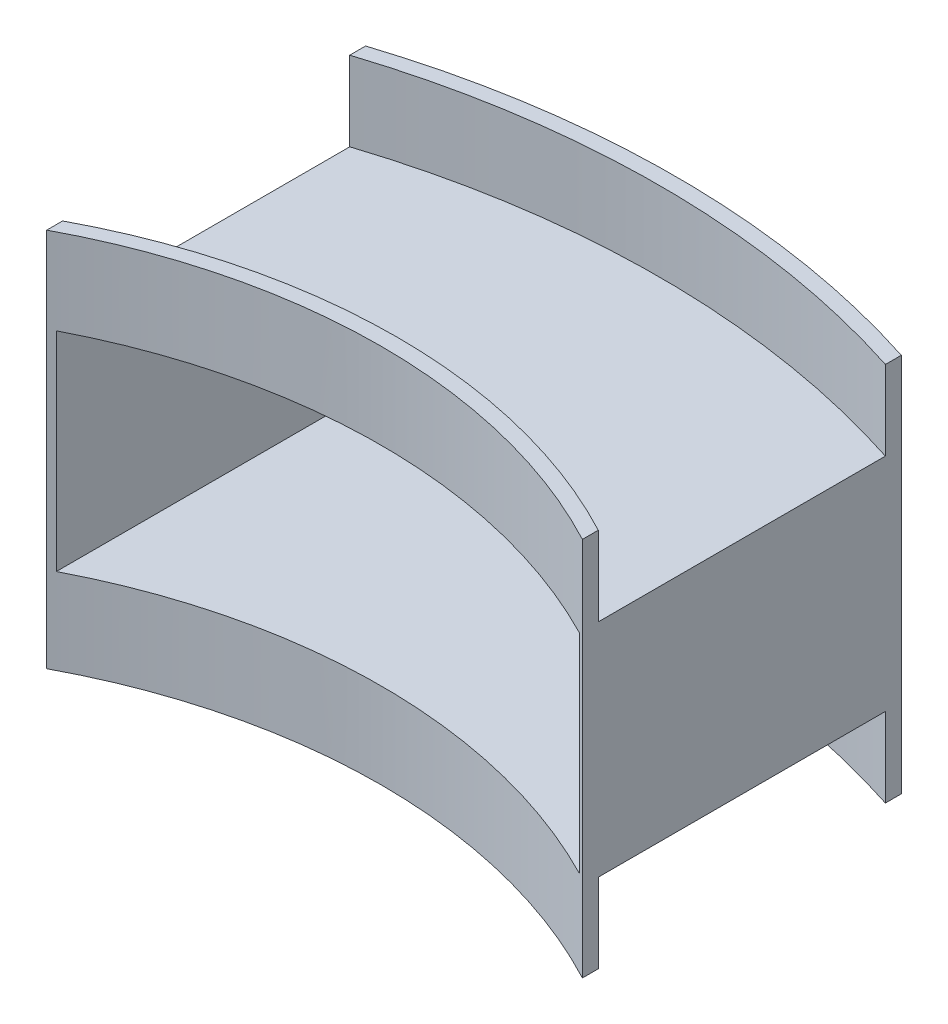
ISO-10303-21;
HEADER;
FILE_DESCRIPTION(('STEP AP214'),'2;1');
FILE_NAME('part.step','',(''),(''),'','','');
FILE_SCHEMA(('AUTOMOTIVE_DESIGN { 1 0 10303 214 1 1 1 1 }'));
ENDSEC;
DATA;
#1=APPLICATION_CONTEXT('core data for automotive mechanical design processes');
#2=APPLICATION_PROTOCOL_DEFINITION('international standard','automotive_design',2000,#1);
#3=PRODUCT_CONTEXT('',#1,'mechanical');
#4=PRODUCT('Part','Part','',(#3));
#5=PRODUCT_RELATED_PRODUCT_CATEGORY('part','',(#4));
#6=PRODUCT_DEFINITION_FORMATION('','',#4);
#7=PRODUCT_DEFINITION_CONTEXT('part definition',#1,'design');
#8=PRODUCT_DEFINITION('design','',#6,#7);
#9=PRODUCT_DEFINITION_SHAPE('','',#8);
#10=(LENGTH_UNIT() NAMED_UNIT(*) SI_UNIT(.MILLI.,.METRE.));
#11=(NAMED_UNIT(*) PLANE_ANGLE_UNIT() SI_UNIT($,.RADIAN.));
#12=(NAMED_UNIT(*) SI_UNIT($,.STERADIAN.) SOLID_ANGLE_UNIT());
#13=UNCERTAINTY_MEASURE_WITH_UNIT(LENGTH_MEASURE(1.E-05),#10,'distance_accuracy_value','');
#14=(GEOMETRIC_REPRESENTATION_CONTEXT(3) GLOBAL_UNCERTAINTY_ASSIGNED_CONTEXT((#13)) GLOBAL_UNIT_ASSIGNED_CONTEXT((#10,
#11,#12)) REPRESENTATION_CONTEXT('',''));
#15=CARTESIAN_POINT('',(0.,0.,0.));
#16=DIRECTION('',(0.,0.,1.));
#17=DIRECTION('',(1.,0.,0.));
#18=AXIS2_PLACEMENT_3D('',#15,#16,#17);
#19=CARTESIAN_POINT('',(-16.873,-6.965,11.37));
#20=DIRECTION('',(0.,1.,0.));
#21=DIRECTION('',(0.,0.,1.));
#22=AXIS2_PLACEMENT_3D('',#19,#20,#21);
#23=PLANE('',#22);
#24=CARTESIAN_POINT('',(0.,-6.965,44.63));
#25=DIRECTION('',(0.,1.,0.));
#26=DIRECTION('',(0.,0.,-1.));
#27=AXIS2_PLACEMENT_3D('',#24,#25,#26);
#28=CIRCLE('',#27,55.);
#29=CARTESIAN_POINT('',(16.873,-6.965,-7.71789270830298));
#30=VERTEX_POINT('',#29);
#31=CARTESIAN_POINT('',(-16.873,-6.965,-7.71789270830298));
#32=VERTEX_POINT('',#31);
#33=EDGE_CURVE('E73',#30,#32,#28,.T.);
#34=ORIENTED_EDGE('',*,*,#33,.F.);
#35=DIRECTION('',(0.,0.,-1.));
#36=VECTOR('',#35,1.);
#37=CARTESIAN_POINT('',(16.873,-6.965,11.37));
#38=LINE('',#37,#36);
#39=CARTESIAN_POINT('',(16.873,-6.965,10.37));
#40=VERTEX_POINT('',#39);
#41=EDGE_CURVE('E322',#40,#30,#38,.T.);
#42=ORIENTED_EDGE('',*,*,#41,.F.);
#43=CARTESIAN_POINT('',(0.,-6.965,42.1709727995859));
#44=DIRECTION('',(0.,-1.,0.));
#45=DIRECTION('',(0.,0.,-1.));
#46=AXIS2_PLACEMENT_3D('',#43,#44,#45);
#47=CIRCLE('',#46,36.);
#48=CARTESIAN_POINT('',(-16.873,-6.965,10.37));
#49=VERTEX_POINT('',#48);
#50=EDGE_CURVE('E211',#49,#40,#47,.T.);
#51=ORIENTED_EDGE('',*,*,#50,.F.);
#52=DIRECTION('',(0.,0.,-1.));
#53=VECTOR('',#52,1.);
#54=CARTESIAN_POINT('',(-16.873,-6.965,11.37));
#55=LINE('',#54,#53);
#56=EDGE_CURVE('E78',#49,#32,#55,.T.);
#57=ORIENTED_EDGE('',*,*,#56,.T.);
#58=EDGE_LOOP('',(#34,#42,#51,#57));
#59=FACE_BOUND('',#58,.T.);
#60=ADVANCED_FACE('F57',(#59),#23,.F.);
#61=CARTESIAN_POINT('',(-16.873,6.965,11.37));
#62=DIRECTION('',(0.,-1.,0.));
#63=DIRECTION('',(0.,0.,-1.));
#64=AXIS2_PLACEMENT_3D('',#61,#62,#63);
#65=PLANE('',#64);
#66=CARTESIAN_POINT('',(0.,6.965,44.63));
#67=DIRECTION('',(0.,-1.,0.));
#68=DIRECTION('',(0.,0.,-1.));
#69=AXIS2_PLACEMENT_3D('',#66,#67,#68);
#70=CIRCLE('',#69,55.);
#71=CARTESIAN_POINT('',(-16.873,6.965,-7.71789270830298));
#72=VERTEX_POINT('',#71);
#73=CARTESIAN_POINT('',(16.873,6.965,-7.71789270830298));
#74=VERTEX_POINT('',#73);
#75=EDGE_CURVE('E237',#72,#74,#70,.T.);
#76=ORIENTED_EDGE('',*,*,#75,.F.);
#77=DIRECTION('',(0.,0.,-1.));
#78=VECTOR('',#77,1.);
#79=CARTESIAN_POINT('',(-16.873,6.965,11.37));
#80=LINE('',#79,#78);
#81=CARTESIAN_POINT('',(-16.873,6.965,10.37));
#82=VERTEX_POINT('',#81);
#83=EDGE_CURVE('E327',#82,#72,#80,.T.);
#84=ORIENTED_EDGE('',*,*,#83,.F.);
#85=CARTESIAN_POINT('',(0.,6.965,42.1709727995859));
#86=DIRECTION('',(0.,1.,0.));
#87=DIRECTION('',(0.,0.,-1.));
#88=AXIS2_PLACEMENT_3D('',#85,#86,#87);
#89=CIRCLE('',#88,36.);
#90=CARTESIAN_POINT('',(16.873,6.965,10.37));
#91=VERTEX_POINT('',#90);
#92=EDGE_CURVE('E258',#91,#82,#89,.T.);
#93=ORIENTED_EDGE('',*,*,#92,.F.);
#94=DIRECTION('',(0.,0.,-1.));
#95=VECTOR('',#94,1.);
#96=CARTESIAN_POINT('',(16.873,6.965,11.37));
#97=LINE('',#96,#95);
#98=EDGE_CURVE('E331',#91,#74,#97,.T.);
#99=ORIENTED_EDGE('',*,*,#98,.T.);
#100=EDGE_LOOP('',(#76,#84,#93,#99));
#101=FACE_BOUND('',#100,.T.);
#102=ADVANCED_FACE('F374',(#101),#65,.F.);
#103=CARTESIAN_POINT('',(-16.473,6.565,11.37));
#104=DIRECTION('',(0.,-1.,0.));
#105=DIRECTION('',(0.,0.,-1.));
#106=AXIS2_PLACEMENT_3D('',#103,#104,#105);
#107=PLANE('',#106);
#108=DIRECTION('',(0.,0.,-1.));
#109=VECTOR('',#108,1.);
#110=CARTESIAN_POINT('',(-16.473,6.565,11.37));
#111=LINE('',#110,#109);
#112=CARTESIAN_POINT('',(-16.473,6.565,11.1609701285457));
#113=VERTEX_POINT('',#112);
#114=CARTESIAN_POINT('',(-16.473,6.565,-8.84513955198214));
#115=VERTEX_POINT('',#114);
#116=EDGE_CURVE('E308',#113,#115,#111,.T.);
#117=ORIENTED_EDGE('',*,*,#116,.T.);
#118=CARTESIAN_POINT('',(0.,6.565,43.63));
#119=DIRECTION('',(0.,-1.,0.));
#120=DIRECTION('',(0.,0.,-1.));
#121=AXIS2_PLACEMENT_3D('',#118,#119,#120);
#122=CIRCLE('',#121,55.);
#123=CARTESIAN_POINT('',(16.473,6.565,-8.84513955198214));
#124=VERTEX_POINT('',#123);
#125=EDGE_CURVE('E288',#124,#115,#122,.F.);
#126=ORIENTED_EDGE('',*,*,#125,.F.);
#127=DIRECTION('',(0.,0.,-1.));
#128=VECTOR('',#127,1.);
#129=CARTESIAN_POINT('',(16.473,6.565,11.37));
#130=LINE('',#129,#128);
#131=CARTESIAN_POINT('',(16.473,6.565,11.1609701285457));
#132=VERTEX_POINT('',#131);
#133=EDGE_CURVE('E312',#132,#124,#130,.T.);
#134=ORIENTED_EDGE('',*,*,#133,.F.);
#135=CARTESIAN_POINT('',(0.,6.565,43.1709727995859));
#136=DIRECTION('',(0.,-1.,0.));
#137=DIRECTION('',(0.,0.,-1.));
#138=AXIS2_PLACEMENT_3D('',#135,#136,#137);
#139=CIRCLE('',#138,36.);
#140=EDGE_CURVE('E294',#113,#132,#139,.T.);
#141=ORIENTED_EDGE('',*,*,#140,.F.);
#142=EDGE_LOOP('',(#117,#126,#134,#141));
#143=FACE_BOUND('',#142,.T.);
#144=ADVANCED_FACE('F357',(#143),#107,.T.);
#145=CARTESIAN_POINT('',(-16.473,-6.565,11.37));
#146=DIRECTION('',(0.,1.,0.));
#147=DIRECTION('',(0.,0.,1.));
#148=AXIS2_PLACEMENT_3D('',#145,#146,#147);
#149=PLANE('',#148);
#150=CARTESIAN_POINT('',(0.,-6.565,43.63));
#151=DIRECTION('',(0.,1.,0.));
#152=DIRECTION('',(0.,0.,1.));
#153=AXIS2_PLACEMENT_3D('',#150,#151,#152);
#154=CIRCLE('',#153,55.);
#155=CARTESIAN_POINT('',(-16.473,-6.565,-8.84513955198214));
#156=VERTEX_POINT('',#155);
#157=CARTESIAN_POINT('',(16.473,-6.565,-8.84513955198214));
#158=VERTEX_POINT('',#157);
#159=EDGE_CURVE('E335',#156,#158,#154,.F.);
#160=ORIENTED_EDGE('',*,*,#159,.F.);
#161=DIRECTION('',(0.,0.,-1.));
#162=VECTOR('',#161,1.);
#163=CARTESIAN_POINT('',(-16.473,-6.565,11.37));
#164=LINE('',#163,#162);
#165=CARTESIAN_POINT('',(-16.473,-6.565,11.1609701285457));
#166=VERTEX_POINT('',#165);
#167=EDGE_CURVE('E304',#166,#156,#164,.T.);
#168=ORIENTED_EDGE('',*,*,#167,.F.);
#169=CARTESIAN_POINT('',(0.,-6.565,43.1709727995859));
#170=DIRECTION('',(0.,1.,0.));
#171=DIRECTION('',(0.,0.,1.));
#172=AXIS2_PLACEMENT_3D('',#169,#170,#171);
#173=CIRCLE('',#172,36.);
#174=CARTESIAN_POINT('',(16.473,-6.565,11.1609701285457));
#175=VERTEX_POINT('',#174);
#176=EDGE_CURVE('E66',#175,#166,#173,.T.);
#177=ORIENTED_EDGE('',*,*,#176,.F.);
#178=DIRECTION('',(0.,0.,-1.));
#179=VECTOR('',#178,1.);
#180=CARTESIAN_POINT('',(16.473,-6.565,11.37));
#181=LINE('',#180,#179);
#182=EDGE_CURVE('E300',#175,#158,#181,.T.);
#183=ORIENTED_EDGE('',*,*,#182,.T.);
#184=EDGE_LOOP('',(#160,#168,#177,#183));
#185=FACE_BOUND('',#184,.T.);
#186=ADVANCED_FACE('F352',(#185),#149,.T.);
#187=CARTESIAN_POINT('',(16.873,-6.965,11.37));
#188=DIRECTION('',(-1.,0.,0.));
#189=DIRECTION('',(0.,0.,1.));
#190=AXIS2_PLACEMENT_3D('',#187,#188,#189);
#191=PLANE('',#190);
#192=DIRECTION('',(0.,1.,0.));
#193=VECTOR('',#192,1.);
#194=CARTESIAN_POINT('',(16.873,-6.965,11.37));
#195=LINE('',#194,#193);
#196=CARTESIAN_POINT('',(16.873,-11.965,11.37));
#197=VERTEX_POINT('',#196);
#198=CARTESIAN_POINT('',(16.873,11.965,11.37));
#199=VERTEX_POINT('',#198);
#200=EDGE_CURVE('E316',#197,#199,#195,.T.);
#201=ORIENTED_EDGE('',*,*,#200,.F.);
#202=DIRECTION('',(0.,0.,1.));
#203=VECTOR('',#202,1.);
#204=CARTESIAN_POINT('',(16.873,-11.965,11.37));
#205=LINE('',#204,#203);
#206=CARTESIAN_POINT('',(16.873,-11.965,10.37));
#207=VERTEX_POINT('',#206);
#208=EDGE_CURVE('E222',#207,#197,#205,.T.);
#209=ORIENTED_EDGE('',*,*,#208,.F.);
#210=DIRECTION('',(0.,1.,0.));
#211=VECTOR('',#210,1.);
#212=CARTESIAN_POINT('',(16.873,-11.965,10.37));
#213=LINE('',#212,#211);
#214=EDGE_CURVE('E226',#207,#40,#213,.T.);
#215=ORIENTED_EDGE('',*,*,#214,.T.);
#216=ORIENTED_EDGE('',*,*,#41,.T.);
#217=DIRECTION('',(0.,1.,0.));
#218=VECTOR('',#217,1.);
#219=CARTESIAN_POINT('',(16.873,-11.965,-7.71789270830298));
#220=LINE('',#219,#218);
#221=CARTESIAN_POINT('',(16.873,-11.965,-7.71789270830298));
#222=VERTEX_POINT('',#221);
#223=EDGE_CURVE('E186',#222,#30,#220,.T.);
#224=ORIENTED_EDGE('',*,*,#223,.F.);
#225=DIRECTION('',(0.,0.,1.));
#226=VECTOR('',#225,1.);
#227=CARTESIAN_POINT('',(16.873,-11.965,-8.71789270830297));
#228=LINE('',#227,#226);
#229=CARTESIAN_POINT('',(16.873,-11.965,-8.71789270830297));
#230=VERTEX_POINT('',#229);
#231=EDGE_CURVE('E184',#230,#222,#228,.T.);
#232=ORIENTED_EDGE('',*,*,#231,.F.);
#233=DIRECTION('',(0.,1.,0.));
#234=VECTOR('',#233,1.);
#235=CARTESIAN_POINT('',(16.873,-6.965,-8.71789270830297));
#236=LINE('',#235,#234);
#237=CARTESIAN_POINT('',(16.873,11.965,-8.71789270830297));
#238=VERTEX_POINT('',#237);
#239=EDGE_CURVE('E169',#230,#238,#236,.T.);
#240=ORIENTED_EDGE('',*,*,#239,.T.);
#241=DIRECTION('',(0.,0.,-1.));
#242=VECTOR('',#241,1.);
#243=CARTESIAN_POINT('',(16.873,11.965,-8.71789270830297));
#244=LINE('',#243,#242);
#245=CARTESIAN_POINT('',(16.873,11.965,-7.71789270830298));
#246=VERTEX_POINT('',#245);
#247=EDGE_CURVE('E246',#246,#238,#244,.T.);
#248=ORIENTED_EDGE('',*,*,#247,.F.);
#249=DIRECTION('',(0.,-1.,0.));
#250=VECTOR('',#249,1.);
#251=CARTESIAN_POINT('',(16.873,11.965,-7.71789270830298));
#252=LINE('',#251,#250);
#253=EDGE_CURVE('E249',#246,#74,#252,.T.);
#254=ORIENTED_EDGE('',*,*,#253,.T.);
#255=ORIENTED_EDGE('',*,*,#98,.F.);
#256=DIRECTION('',(0.,-1.,0.));
#257=VECTOR('',#256,1.);
#258=CARTESIAN_POINT('',(16.873,11.965,10.37));
#259=LINE('',#258,#257);
#260=CARTESIAN_POINT('',(16.873,11.965,10.37));
#261=VERTEX_POINT('',#260);
#262=EDGE_CURVE('E280',#261,#91,#259,.T.);
#263=ORIENTED_EDGE('',*,*,#262,.F.);
#264=DIRECTION('',(0.,0.,-1.));
#265=VECTOR('',#264,1.);
#266=CARTESIAN_POINT('',(16.873,11.965,11.37));
#267=LINE('',#266,#265);
#268=EDGE_CURVE('E263',#199,#261,#267,.T.);
#269=ORIENTED_EDGE('',*,*,#268,.F.);
#270=EDGE_LOOP('',(#201,#209,#215,#216,#224,#232,#240,#248,#254,#255,#263,#269));
#271=FACE_BOUND('',#270,.T.);
#272=ADVANCED_FACE('F59',(#271),#191,.F.);
#273=CARTESIAN_POINT('',(-16.873,-6.965,11.37));
#274=DIRECTION('',(1.,0.,0.));
#275=DIRECTION('',(0.,0.,-1.));
#276=AXIS2_PLACEMENT_3D('',#273,#274,#275);
#277=PLANE('',#276);
#278=DIRECTION('',(0.,-1.,0.));
#279=VECTOR('',#278,1.);
#280=CARTESIAN_POINT('',(-16.873,-6.965,11.37));
#281=LINE('',#280,#279);
#282=CARTESIAN_POINT('',(-16.873,11.965,11.37));
#283=VERTEX_POINT('',#282);
#284=CARTESIAN_POINT('',(-16.873,-11.965,11.37));
#285=VERTEX_POINT('',#284);
#286=EDGE_CURVE('E319',#283,#285,#281,.T.);
#287=ORIENTED_EDGE('',*,*,#286,.F.);
#288=DIRECTION('',(0.,0.,1.));
#289=VECTOR('',#288,1.);
#290=CARTESIAN_POINT('',(-16.873,11.965,11.37));
#291=LINE('',#290,#289);
#292=CARTESIAN_POINT('',(-16.873,11.965,10.37));
#293=VERTEX_POINT('',#292);
#294=EDGE_CURVE('E269',#293,#283,#291,.T.);
#295=ORIENTED_EDGE('',*,*,#294,.F.);
#296=DIRECTION('',(0.,-1.,0.));
#297=VECTOR('',#296,1.);
#298=CARTESIAN_POINT('',(-16.873,11.965,10.37));
#299=LINE('',#298,#297);
#300=EDGE_CURVE('E273',#293,#82,#299,.T.);
#301=ORIENTED_EDGE('',*,*,#300,.T.);
#302=ORIENTED_EDGE('',*,*,#83,.T.);
#303=DIRECTION('',(0.,-1.,0.));
#304=VECTOR('',#303,1.);
#305=CARTESIAN_POINT('',(-16.873,11.965,-7.71789270830298));
#306=LINE('',#305,#304);
#307=CARTESIAN_POINT('',(-16.873,11.965,-7.71789270830298));
#308=VERTEX_POINT('',#307);
#309=EDGE_CURVE('E255',#308,#72,#306,.T.);
#310=ORIENTED_EDGE('',*,*,#309,.F.);
#311=DIRECTION('',(0.,0.,1.));
#312=VECTOR('',#311,1.);
#313=CARTESIAN_POINT('',(-16.873,11.965,-8.71789270830297));
#314=LINE('',#313,#312);
#315=CARTESIAN_POINT('',(-16.873,11.965,-8.71789270830297));
#316=VERTEX_POINT('',#315);
#317=EDGE_CURVE('E240',#316,#308,#314,.T.);
#318=ORIENTED_EDGE('',*,*,#317,.F.);
#319=DIRECTION('',(0.,1.,0.));
#320=VECTOR('',#319,1.);
#321=CARTESIAN_POINT('',(-16.873,-6.965,-8.71789270830297));
#322=LINE('',#321,#320);
#323=CARTESIAN_POINT('',(-16.873,-11.965,-8.71789270830297));
#324=VERTEX_POINT('',#323);
#325=EDGE_CURVE('E181',#324,#316,#322,.T.);
#326=ORIENTED_EDGE('',*,*,#325,.F.);
#327=DIRECTION('',(0.,0.,-1.));
#328=VECTOR('',#327,1.);
#329=CARTESIAN_POINT('',(-16.873,-11.965,-8.71789270830297));
#330=LINE('',#329,#328);
#331=CARTESIAN_POINT('',(-16.873,-11.965,-7.71789270830298));
#332=VERTEX_POINT('',#331);
#333=EDGE_CURVE('E195',#332,#324,#330,.T.);
#334=ORIENTED_EDGE('',*,*,#333,.F.);
#335=DIRECTION('',(0.,1.,0.));
#336=VECTOR('',#335,1.);
#337=CARTESIAN_POINT('',(-16.873,-11.965,-7.71789270830298));
#338=LINE('',#337,#336);
#339=EDGE_CURVE('E204',#332,#32,#338,.T.);
#340=ORIENTED_EDGE('',*,*,#339,.T.);
#341=ORIENTED_EDGE('',*,*,#56,.F.);
#342=DIRECTION('',(0.,1.,0.));
#343=VECTOR('',#342,1.);
#344=CARTESIAN_POINT('',(-16.873,-11.965,10.37));
#345=LINE('',#344,#343);
#346=CARTESIAN_POINT('',(-16.873,-11.965,10.37));
#347=VERTEX_POINT('',#346);
#348=EDGE_CURVE('E233',#347,#49,#345,.T.);
#349=ORIENTED_EDGE('',*,*,#348,.F.);
#350=DIRECTION('',(0.,0.,-1.));
#351=VECTOR('',#350,1.);
#352=CARTESIAN_POINT('',(-16.873,-11.965,11.37));
#353=LINE('',#352,#351);
#354=EDGE_CURVE('E216',#285,#347,#353,.T.);
#355=ORIENTED_EDGE('',*,*,#354,.F.);
#356=EDGE_LOOP('',(#287,#295,#301,#302,#310,#318,#326,#334,#340,#341,#349,#355));
#357=FACE_BOUND('',#356,.T.);
#358=ADVANCED_FACE('F362',(#357),#277,.F.);
#359=CARTESIAN_POINT('',(16.473,-6.565,11.37));
#360=DIRECTION('',(-1.,0.,0.));
#361=DIRECTION('',(0.,0.,1.));
#362=AXIS2_PLACEMENT_3D('',#359,#360,#361);
#363=PLANE('',#362);
#364=DIRECTION('',(0.,1.,0.));
#365=VECTOR('',#364,1.);
#366=CARTESIAN_POINT('',(16.473,-6.965,11.1609701285457));
#367=LINE('',#366,#365);
#368=EDGE_CURVE('E297',#132,#175,#367,.F.);
#369=ORIENTED_EDGE('',*,*,#368,.F.);
#370=ORIENTED_EDGE('',*,*,#133,.T.);
#371=DIRECTION('',(0.,1.,0.));
#372=VECTOR('',#371,1.);
#373=CARTESIAN_POINT('',(16.473,-6.965,-8.84513955198214));
#374=LINE('',#373,#372);
#375=EDGE_CURVE('E180',#158,#124,#374,.T.);
#376=ORIENTED_EDGE('',*,*,#375,.F.);
#377=ORIENTED_EDGE('',*,*,#182,.F.);
#378=EDGE_LOOP('',(#369,#370,#376,#377));
#379=FACE_BOUND('',#378,.T.);
#380=ADVANCED_FACE('F360',(#379),#363,.T.);
#381=CARTESIAN_POINT('',(-16.473,-6.565,11.37));
#382=DIRECTION('',(1.,0.,0.));
#383=DIRECTION('',(0.,0.,-1.));
#384=AXIS2_PLACEMENT_3D('',#381,#382,#383);
#385=PLANE('',#384);
#386=DIRECTION('',(0.,1.,0.));
#387=VECTOR('',#386,1.);
#388=CARTESIAN_POINT('',(-16.473,-6.965,-8.84513955198214));
#389=LINE('',#388,#387);
#390=EDGE_CURVE('E12',#115,#156,#389,.F.);
#391=ORIENTED_EDGE('',*,*,#390,.F.);
#392=ORIENTED_EDGE('',*,*,#116,.F.);
#393=DIRECTION('',(0.,1.,0.));
#394=VECTOR('',#393,1.);
#395=CARTESIAN_POINT('',(-16.473,-6.965,11.1609701285457));
#396=LINE('',#395,#394);
#397=EDGE_CURVE('E291',#166,#113,#396,.T.);
#398=ORIENTED_EDGE('',*,*,#397,.F.);
#399=ORIENTED_EDGE('',*,*,#167,.T.);
#400=EDGE_LOOP('',(#391,#392,#398,#399));
#401=FACE_BOUND('',#400,.T.);
#402=ADVANCED_FACE('F351',(#401),#385,.T.);
#403=CARTESIAN_POINT('',(0.,-6.965,43.63));
#404=DIRECTION('',(0.,1.,0.));
#405=DIRECTION('',(0.,0.,1.));
#406=AXIS2_PLACEMENT_3D('',#403,#404,#405);
#407=CYLINDRICAL_SURFACE('',#406,55.);
#408=ORIENTED_EDGE('',*,*,#390,.T.);
#409=ORIENTED_EDGE('',*,*,#159,.T.);
#410=ORIENTED_EDGE('',*,*,#375,.T.);
#411=ORIENTED_EDGE('',*,*,#125,.T.);
#412=EDGE_LOOP('',(#408,#409,#410,#411));
#413=FACE_BOUND('',#412,.T.);
#414=ORIENTED_EDGE('',*,*,#239,.F.);
#415=CARTESIAN_POINT('',(0.,-11.965,43.6299999999993));
#416=DIRECTION('',(0.,-1.,0.));
#417=DIRECTION('',(0.,0.,-1.));
#418=AXIS2_PLACEMENT_3D('',#415,#416,#417);
#419=CIRCLE('',#418,54.9999999999994);
#420=EDGE_CURVE('E173',#324,#230,#419,.T.);
#421=ORIENTED_EDGE('',*,*,#420,.F.);
#422=ORIENTED_EDGE('',*,*,#325,.T.);
#423=CARTESIAN_POINT('',(0.,11.965,43.629999999999));
#424=DIRECTION('',(0.,1.,0.));
#425=DIRECTION('',(0.,0.,-1.));
#426=AXIS2_PLACEMENT_3D('',#423,#424,#425);
#427=CIRCLE('',#426,54.999999999999);
#428=EDGE_CURVE('E175',#238,#316,#427,.T.);
#429=ORIENTED_EDGE('',*,*,#428,.F.);
#430=EDGE_LOOP('',(#414,#421,#422,#429));
#431=FACE_BOUND('',#430,.T.);
#432=ADVANCED_FACE('F171',(#413,#431),#407,.T.);
#433=CARTESIAN_POINT('',(0.,-6.965,43.1709727995859));
#434=DIRECTION('',(0.,1.,0.));
#435=DIRECTION('',(0.,0.,1.));
#436=AXIS2_PLACEMENT_3D('',#433,#434,#435);
#437=CYLINDRICAL_SURFACE('',#436,36.);
#438=ORIENTED_EDGE('',*,*,#368,.T.);
#439=ORIENTED_EDGE('',*,*,#176,.T.);
#440=ORIENTED_EDGE('',*,*,#397,.T.);
#441=ORIENTED_EDGE('',*,*,#140,.T.);
#442=EDGE_LOOP('',(#438,#439,#440,#441));
#443=FACE_BOUND('',#442,.T.);
#444=ORIENTED_EDGE('',*,*,#200,.T.);
#445=CARTESIAN_POINT('',(0.,11.965,43.1709727995859));
#446=DIRECTION('',(0.,-1.,0.));
#447=DIRECTION('',(0.,0.,-1.));
#448=AXIS2_PLACEMENT_3D('',#445,#446,#447);
#449=CIRCLE('',#448,36.);
#450=EDGE_CURVE('E259',#283,#199,#449,.T.);
#451=ORIENTED_EDGE('',*,*,#450,.F.);
#452=ORIENTED_EDGE('',*,*,#286,.T.);
#453=CARTESIAN_POINT('',(0.,-11.965,43.170972799586));
#454=DIRECTION('',(0.,1.,0.));
#455=DIRECTION('',(0.,0.,-1.));
#456=AXIS2_PLACEMENT_3D('',#453,#454,#455);
#457=CIRCLE('',#456,36.0000000000001);
#458=EDGE_CURVE('E212',#197,#285,#457,.T.);
#459=ORIENTED_EDGE('',*,*,#458,.F.);
#460=EDGE_LOOP('',(#444,#451,#452,#459));
#461=FACE_BOUND('',#460,.T.);
#462=ADVANCED_FACE('F341',(#443,#461),#437,.F.);
#463=CARTESIAN_POINT('',(0.,11.965,42.1709727995859));
#464=DIRECTION('',(0.,-1.,0.));
#465=DIRECTION('',(0.,0.,-1.));
#466=AXIS2_PLACEMENT_3D('',#463,#464,#465);
#467=CYLINDRICAL_SURFACE('',#466,36.);
#468=ORIENTED_EDGE('',*,*,#92,.T.);
#469=ORIENTED_EDGE('',*,*,#300,.F.);
#470=CARTESIAN_POINT('',(0.,11.965,42.1709727995859));
#471=DIRECTION('',(0.,1.,0.));
#472=DIRECTION('',(0.,0.,-1.));
#473=AXIS2_PLACEMENT_3D('',#470,#471,#472);
#474=CIRCLE('',#473,36.);
#475=EDGE_CURVE('E266',#261,#293,#474,.T.);
#476=ORIENTED_EDGE('',*,*,#475,.F.);
#477=ORIENTED_EDGE('',*,*,#262,.T.);
#478=EDGE_LOOP('',(#468,#469,#476,#477));
#479=FACE_BOUND('',#478,.T.);
#480=ADVANCED_FACE('F393',(#479),#467,.T.);
#481=CARTESIAN_POINT('',(0.,11.965,43.1709727995859));
#482=DIRECTION('',(0.,-1.,0.));
#483=DIRECTION('',(0.,0.,-1.));
#484=AXIS2_PLACEMENT_3D('',#481,#482,#483);
#485=PLANE('',#484);
#486=ORIENTED_EDGE('',*,*,#450,.T.);
#487=ORIENTED_EDGE('',*,*,#268,.T.);
#488=ORIENTED_EDGE('',*,*,#475,.T.);
#489=ORIENTED_EDGE('',*,*,#294,.T.);
#490=EDGE_LOOP('',(#486,#487,#488,#489));
#491=FACE_BOUND('',#490,.T.);
#492=ADVANCED_FACE('F422',(#491),#485,.F.);
#493=CARTESIAN_POINT('',(0.,11.965,44.63));
#494=DIRECTION('',(0.,-1.,0.));
#495=DIRECTION('',(0.,0.,-1.));
#496=AXIS2_PLACEMENT_3D('',#493,#494,#495);
#497=CYLINDRICAL_SURFACE('',#496,55.);
#498=ORIENTED_EDGE('',*,*,#75,.T.);
#499=ORIENTED_EDGE('',*,*,#253,.F.);
#500=CARTESIAN_POINT('',(0.,11.965,44.63));
#501=DIRECTION('',(0.,-1.,0.));
#502=DIRECTION('',(0.,0.,-1.));
#503=AXIS2_PLACEMENT_3D('',#500,#501,#502);
#504=CIRCLE('',#503,55.);
#505=EDGE_CURVE('E243',#308,#246,#504,.T.);
#506=ORIENTED_EDGE('',*,*,#505,.F.);
#507=ORIENTED_EDGE('',*,*,#309,.T.);
#508=EDGE_LOOP('',(#498,#499,#506,#507));
#509=FACE_BOUND('',#508,.T.);
#510=ADVANCED_FACE('F396',(#509),#497,.F.);
#511=CARTESIAN_POINT('',(0.,11.965,43.629999999999));
#512=DIRECTION('',(0.,-1.,0.));
#513=DIRECTION('',(0.,0.,-1.));
#514=AXIS2_PLACEMENT_3D('',#511,#512,#513);
#515=PLANE('',#514);
#516=ORIENTED_EDGE('',*,*,#428,.T.);
#517=ORIENTED_EDGE('',*,*,#317,.T.);
#518=ORIENTED_EDGE('',*,*,#505,.T.);
#519=ORIENTED_EDGE('',*,*,#247,.T.);
#520=EDGE_LOOP('',(#516,#517,#518,#519));
#521=FACE_BOUND('',#520,.T.);
#522=ADVANCED_FACE('F398',(#521),#515,.F.);
#523=CARTESIAN_POINT('',(0.,-11.965,42.1709727995859));
#524=DIRECTION('',(0.,1.,0.));
#525=DIRECTION('',(0.,0.,1.));
#526=AXIS2_PLACEMENT_3D('',#523,#524,#525);
#527=CYLINDRICAL_SURFACE('',#526,36.);
#528=ORIENTED_EDGE('',*,*,#50,.T.);
#529=ORIENTED_EDGE('',*,*,#214,.F.);
#530=CARTESIAN_POINT('',(0.,-11.965,42.1709727995859));
#531=DIRECTION('',(0.,-1.,0.));
#532=DIRECTION('',(0.,0.,-1.));
#533=AXIS2_PLACEMENT_3D('',#530,#531,#532);
#534=CIRCLE('',#533,36.);
#535=EDGE_CURVE('E219',#347,#207,#534,.T.);
#536=ORIENTED_EDGE('',*,*,#535,.F.);
#537=ORIENTED_EDGE('',*,*,#348,.T.);
#538=EDGE_LOOP('',(#528,#529,#536,#537));
#539=FACE_BOUND('',#538,.T.);
#540=ADVANCED_FACE('F411',(#539),#527,.T.);
#541=CARTESIAN_POINT('',(0.,-11.965,43.170972799586));
#542=DIRECTION('',(0.,-1.,0.));
#543=DIRECTION('',(0.,0.,-1.));
#544=AXIS2_PLACEMENT_3D('',#541,#542,#543);
#545=PLANE('',#544);
#546=ORIENTED_EDGE('',*,*,#458,.T.);
#547=ORIENTED_EDGE('',*,*,#354,.T.);
#548=ORIENTED_EDGE('',*,*,#535,.T.);
#549=ORIENTED_EDGE('',*,*,#208,.T.);
#550=EDGE_LOOP('',(#546,#547,#548,#549));
#551=FACE_BOUND('',#550,.T.);
#552=ADVANCED_FACE('F404',(#551),#545,.T.);
#553=CARTESIAN_POINT('',(0.,-11.965,44.63));
#554=DIRECTION('',(0.,1.,0.));
#555=DIRECTION('',(0.,0.,1.));
#556=AXIS2_PLACEMENT_3D('',#553,#554,#555);
#557=CYLINDRICAL_SURFACE('',#556,55.);
#558=ORIENTED_EDGE('',*,*,#33,.T.);
#559=ORIENTED_EDGE('',*,*,#339,.F.);
#560=CARTESIAN_POINT('',(0.,-11.965,44.63));
#561=DIRECTION('',(0.,1.,0.));
#562=DIRECTION('',(0.,0.,-1.));
#563=AXIS2_PLACEMENT_3D('',#560,#561,#562);
#564=CIRCLE('',#563,55.);
#565=EDGE_CURVE('E190',#222,#332,#564,.T.);
#566=ORIENTED_EDGE('',*,*,#565,.F.);
#567=ORIENTED_EDGE('',*,*,#223,.T.);
#568=EDGE_LOOP('',(#558,#559,#566,#567));
#569=FACE_BOUND('',#568,.T.);
#570=ADVANCED_FACE('F402',(#569),#557,.F.);
#571=CARTESIAN_POINT('',(0.,-11.965,43.6299999999993));
#572=DIRECTION('',(0.,-1.,0.));
#573=DIRECTION('',(0.,0.,-1.));
#574=AXIS2_PLACEMENT_3D('',#571,#572,#573);
#575=PLANE('',#574);
#576=ORIENTED_EDGE('',*,*,#420,.T.);
#577=ORIENTED_EDGE('',*,*,#231,.T.);
#578=ORIENTED_EDGE('',*,*,#565,.T.);
#579=ORIENTED_EDGE('',*,*,#333,.T.);
#580=EDGE_LOOP('',(#576,#577,#578,#579));
#581=FACE_BOUND('',#580,.T.);
#582=ADVANCED_FACE('F193',(#581),#575,.T.);
#583=CLOSED_SHELL('',(#60,#102,#144,#186,#272,#358,#380,#402,#432,#462,#480,#492,#510,#522,#540,
#552,#570,#582));
#584=MANIFOLD_SOLID_BREP('B2',#583);
#585=ADVANCED_BREP_SHAPE_REPRESENTATION('',(#18,#584),#14);
#586=SHAPE_DEFINITION_REPRESENTATION(#9,#585);
ENDSEC;
END-ISO-10303-21;
